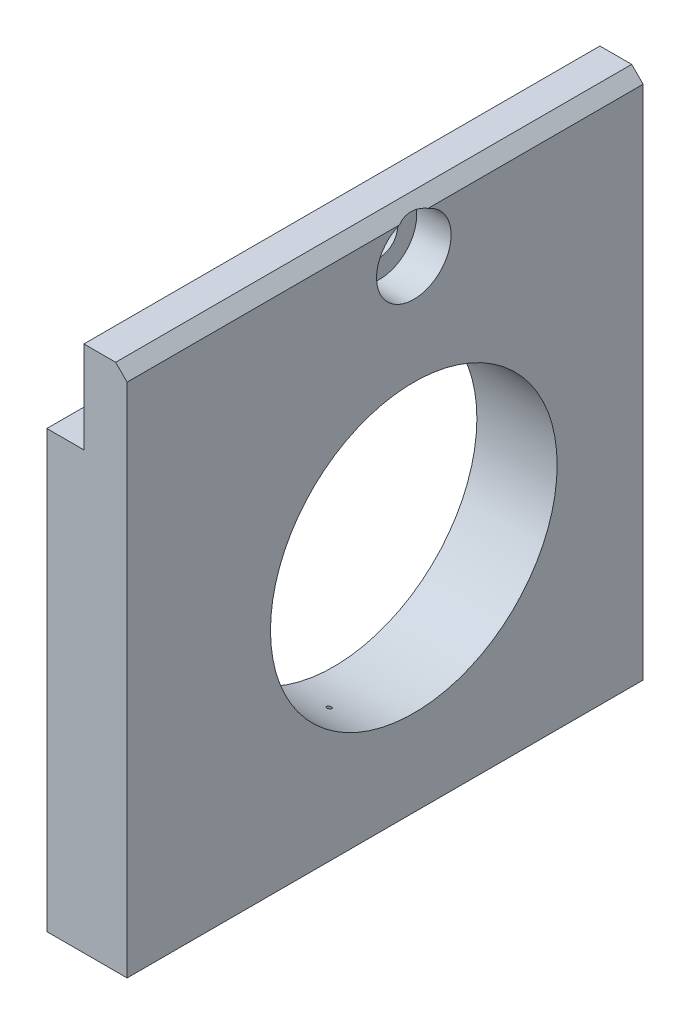
ISO-10303-21;
HEADER;
FILE_DESCRIPTION(('STEP AP214'),'2;1');
FILE_NAME('part.step','',(''),(''),'','','');
FILE_SCHEMA(('AUTOMOTIVE_DESIGN { 1 0 10303 214 1 1 1 1 }'));
ENDSEC;
DATA;
#1=APPLICATION_CONTEXT('core data for automotive mechanical design processes');
#2=APPLICATION_PROTOCOL_DEFINITION('international standard','automotive_design',2000,#1);
#3=PRODUCT_CONTEXT('',#1,'mechanical');
#4=PRODUCT('Part','Part','',(#3));
#5=PRODUCT_RELATED_PRODUCT_CATEGORY('part','',(#4));
#6=PRODUCT_DEFINITION_FORMATION('','',#4);
#7=PRODUCT_DEFINITION_CONTEXT('part definition',#1,'design');
#8=PRODUCT_DEFINITION('design','',#6,#7);
#9=PRODUCT_DEFINITION_SHAPE('','',#8);
#10=(LENGTH_UNIT() NAMED_UNIT(*) SI_UNIT(.MILLI.,.METRE.));
#11=(NAMED_UNIT(*) PLANE_ANGLE_UNIT() SI_UNIT($,.RADIAN.));
#12=(NAMED_UNIT(*) SI_UNIT($,.STERADIAN.) SOLID_ANGLE_UNIT());
#13=UNCERTAINTY_MEASURE_WITH_UNIT(LENGTH_MEASURE(1.E-05),#10,'distance_accuracy_value','');
#14=(GEOMETRIC_REPRESENTATION_CONTEXT(3) GLOBAL_UNCERTAINTY_ASSIGNED_CONTEXT((#13)) GLOBAL_UNIT_ASSIGNED_CONTEXT((#10,
#11,#12)) REPRESENTATION_CONTEXT('',''));
#15=CARTESIAN_POINT('',(0.,0.,0.));
#16=DIRECTION('',(0.,0.,1.));
#17=DIRECTION('',(1.,0.,0.));
#18=AXIS2_PLACEMENT_3D('',#15,#16,#17);
#19=CARTESIAN_POINT('',(0.,-15.6372549019608,45.));
#20=DIRECTION('',(0.,1.,0.));
#21=DIRECTION('',(0.,0.,1.));
#22=AXIS2_PLACEMENT_3D('',#19,#20,#21);
#23=PLANE('',#22);
#24=CARTESIAN_POINT('',(3.5,-15.6372549019608,38.));
#25=DIRECTION('',(0.,-1.,0.));
#26=DIRECTION('',(0.,0.,-1.));
#27=AXIS2_PLACEMENT_3D('',#24,#25,#26);
#28=CIRCLE('',#27,1.5);
#29=CARTESIAN_POINT('',(3.5,-15.6372549019608,36.5));
#30=VERTEX_POINT('',#29);
#31=EDGE_CURVE('E129',#30,#30,#28,.T.);
#32=ORIENTED_EDGE('',*,*,#31,.F.);
#33=EDGE_LOOP('',(#32));
#34=FACE_BOUND('',#33,.T.);
#35=CARTESIAN_POINT('',(3.5,-15.6372549019608,24.));
#36=DIRECTION('',(0.,-1.,0.));
#37=DIRECTION('',(0.,0.,-1.));
#38=AXIS2_PLACEMENT_3D('',#35,#36,#37);
#39=CIRCLE('',#38,1.24999999999999);
#40=CARTESIAN_POINT('',(3.5,-15.6372549019608,22.75));
#41=VERTEX_POINT('',#40);
#42=EDGE_CURVE('E139',#41,#41,#39,.T.);
#43=ORIENTED_EDGE('',*,*,#42,.F.);
#44=EDGE_LOOP('',(#43));
#45=FACE_BOUND('',#44,.T.);
#46=DIRECTION('',(1.,0.,0.));
#47=VECTOR('',#46,1.);
#48=CARTESIAN_POINT('',(0.,-15.6372549019608,0.));
#49=LINE('',#48,#47);
#50=CARTESIAN_POINT('',(0.,-15.6372549019608,0.));
#51=VERTEX_POINT('',#50);
#52=CARTESIAN_POINT('',(7.,-15.6372549019608,0.));
#53=VERTEX_POINT('',#52);
#54=EDGE_CURVE('E182',#51,#53,#49,.T.);
#55=ORIENTED_EDGE('',*,*,#54,.T.);
#56=DIRECTION('',(0.,0.,-1.));
#57=VECTOR('',#56,1.);
#58=CARTESIAN_POINT('',(7.,-15.6372549019608,45.));
#59=LINE('',#58,#57);
#60=CARTESIAN_POINT('',(7.,-15.6372549019608,45.));
#61=VERTEX_POINT('',#60);
#62=EDGE_CURVE('E173',#61,#53,#59,.T.);
#63=ORIENTED_EDGE('',*,*,#62,.F.);
#64=DIRECTION('',(1.,0.,0.));
#65=VECTOR('',#64,1.);
#66=CARTESIAN_POINT('',(0.,-15.6372549019608,45.));
#67=LINE('',#66,#65);
#68=CARTESIAN_POINT('',(0.,-15.6372549019608,45.));
#69=VERTEX_POINT('',#68);
#70=EDGE_CURVE('E169',#69,#61,#67,.T.);
#71=ORIENTED_EDGE('',*,*,#70,.F.);
#72=DIRECTION('',(0.,0.,-1.));
#73=VECTOR('',#72,1.);
#74=CARTESIAN_POINT('',(0.,-15.6372549019608,45.));
#75=LINE('',#74,#73);
#76=EDGE_CURVE('E188',#69,#51,#75,.T.);
#77=ORIENTED_EDGE('',*,*,#76,.T.);
#78=EDGE_LOOP('',(#55,#63,#71,#77));
#79=FACE_BOUND('',#78,.T.);
#80=CARTESIAN_POINT('',(3.5,-15.6372549019608,7.));
#81=DIRECTION('',(0.,-1.,0.));
#82=DIRECTION('',(0.,0.,-1.));
#83=AXIS2_PLACEMENT_3D('',#80,#81,#82);
#84=CIRCLE('',#83,1.5);
#85=CARTESIAN_POINT('',(3.5,-15.6372549019608,5.5));
#86=VERTEX_POINT('',#85);
#87=EDGE_CURVE('E128',#86,#86,#84,.T.);
#88=ORIENTED_EDGE('',*,*,#87,.F.);
#89=EDGE_LOOP('',(#88));
#90=FACE_BOUND('',#89,.T.);
#91=ADVANCED_FACE('F42',(#34,#45,#79,#90),#23,.F.);
#92=CARTESIAN_POINT('',(7.,-15.6372549019608,45.));
#93=DIRECTION('',(-1.,0.,0.));
#94=DIRECTION('',(0.,0.,1.));
#95=AXIS2_PLACEMENT_3D('',#92,#93,#94);
#96=PLANE('',#95);
#97=DIRECTION('',(0.,1.,0.));
#98=VECTOR('',#97,1.);
#99=CARTESIAN_POINT('',(7.,-15.6372549019608,0.));
#100=LINE('',#99,#98);
#101=CARTESIAN_POINT('',(7.,29.3627450980392,0.));
#102=VERTEX_POINT('',#101);
#103=EDGE_CURVE('E163',#53,#102,#100,.T.);
#104=ORIENTED_EDGE('',*,*,#103,.T.);
#105=DIRECTION('',(0.,0.,1.));
#106=VECTOR('',#105,1.);
#107=CARTESIAN_POINT('',(7.,29.3627450980392,45.));
#108=LINE('',#107,#106);
#109=CARTESIAN_POINT('',(7.,29.3627450980392,18.75));
#110=VERTEX_POINT('',#109);
#111=EDGE_CURVE('E208',#102,#110,#108,.T.);
#112=ORIENTED_EDGE('',*,*,#111,.T.);
#113=CARTESIAN_POINT('',(7.,26.3627450980392,20.));
#114=DIRECTION('',(1.,0.,0.));
#115=DIRECTION('',(0.,0.,-1.));
#116=AXIS2_PLACEMENT_3D('',#113,#114,#115);
#117=CIRCLE('',#116,3.25);
#118=CARTESIAN_POINT('',(7.,29.3627450980392,21.25));
#119=VERTEX_POINT('',#118);
#120=EDGE_CURVE('E151',#119,#110,#117,.T.);
#121=ORIENTED_EDGE('',*,*,#120,.F.);
#122=DIRECTION('',(0.,0.,1.));
#123=VECTOR('',#122,1.);
#124=CARTESIAN_POINT('',(7.,29.3627450980392,45.));
#125=LINE('',#124,#123);
#126=CARTESIAN_POINT('',(7.,29.3627450980392,45.));
#127=VERTEX_POINT('',#126);
#128=EDGE_CURVE('E64',#119,#127,#125,.T.);
#129=ORIENTED_EDGE('',*,*,#128,.T.);
#130=DIRECTION('',(0.,1.,0.));
#131=VECTOR('',#130,1.);
#132=CARTESIAN_POINT('',(7.,-15.6372549019608,45.));
#133=LINE('',#132,#131);
#134=EDGE_CURVE('E171',#61,#127,#133,.T.);
#135=ORIENTED_EDGE('',*,*,#134,.F.);
#136=ORIENTED_EDGE('',*,*,#62,.T.);
#137=EDGE_LOOP('',(#104,#112,#121,#129,#135,#136));
#138=FACE_BOUND('',#137,.T.);
#139=CARTESIAN_POINT('',(7.,4.36274509803914,20.));
#140=DIRECTION('',(1.,0.,0.));
#141=DIRECTION('',(0.,0.,-1.));
#142=AXIS2_PLACEMENT_3D('',#139,#140,#141);
#143=CIRCLE('',#142,12.5);
#144=CARTESIAN_POINT('',(7.,4.36274509803914,7.50000000000001));
#145=VERTEX_POINT('',#144);
#146=EDGE_CURVE('E145',#145,#145,#143,.T.);
#147=ORIENTED_EDGE('',*,*,#146,.F.);
#148=EDGE_LOOP('',(#147));
#149=FACE_BOUND('',#148,.T.);
#150=ADVANCED_FACE('F211',(#138,#149),#96,.F.);
#151=CARTESIAN_POINT('',(3.23,30.3627450980392,45.));
#152=DIRECTION('',(0.,-1.,0.));
#153=DIRECTION('',(0.,0.,-1.));
#154=AXIS2_PLACEMENT_3D('',#151,#152,#153);
#155=PLANE('',#154);
#156=DIRECTION('',(-1.,0.,0.));
#157=VECTOR('',#156,1.);
#158=CARTESIAN_POINT('',(3.23,30.3627450980392,45.));
#159=LINE('',#158,#157);
#160=CARTESIAN_POINT('',(6.,30.3627450980392,45.));
#161=VERTEX_POINT('',#160);
#162=CARTESIAN_POINT('',(3.23,30.3627450980392,45.));
#163=VERTEX_POINT('',#162);
#164=EDGE_CURVE('E160',#161,#163,#159,.T.);
#165=ORIENTED_EDGE('',*,*,#164,.F.);
#166=DIRECTION('',(0.,0.,-1.));
#167=VECTOR('',#166,1.);
#168=CARTESIAN_POINT('',(6.,30.3627450980392,45.));
#169=LINE('',#168,#167);
#170=CARTESIAN_POINT('',(6.,30.3627450980392,0.));
#171=VERTEX_POINT('',#170);
#172=EDGE_CURVE('E200',#161,#171,#169,.T.);
#173=ORIENTED_EDGE('',*,*,#172,.T.);
#174=DIRECTION('',(-1.,0.,0.));
#175=VECTOR('',#174,1.);
#176=CARTESIAN_POINT('',(3.23,30.3627450980392,0.));
#177=LINE('',#176,#175);
#178=CARTESIAN_POINT('',(3.23,30.3627450980392,0.));
#179=VERTEX_POINT('',#178);
#180=EDGE_CURVE('E174',#171,#179,#177,.T.);
#181=ORIENTED_EDGE('',*,*,#180,.T.);
#182=DIRECTION('',(0.,0.,-1.));
#183=VECTOR('',#182,1.);
#184=CARTESIAN_POINT('',(3.23,30.3627450980392,45.));
#185=LINE('',#184,#183);
#186=EDGE_CURVE('E197',#163,#179,#185,.T.);
#187=ORIENTED_EDGE('',*,*,#186,.F.);
#188=EDGE_LOOP('',(#165,#173,#181,#187));
#189=FACE_BOUND('',#188,.T.);
#190=ADVANCED_FACE('F224',(#189),#155,.F.);
#191=CARTESIAN_POINT('',(3.23,30.3627450980392,45.));
#192=DIRECTION('',(1.,0.,0.));
#193=DIRECTION('',(0.,1.,0.));
#194=AXIS2_PLACEMENT_3D('',#191,#192,#193);
#195=PLANE('',#194);
#196=CARTESIAN_POINT('',(3.23,26.3627450980392,20.));
#197=DIRECTION('',(1.,0.,0.));
#198=DIRECTION('',(0.,1.,0.));
#199=AXIS2_PLACEMENT_3D('',#196,#197,#198);
#200=CIRCLE('',#199,1.6);
#201=CARTESIAN_POINT('',(3.23,27.9627450980392,20.));
#202=VERTEX_POINT('',#201);
#203=EDGE_CURVE('E159',#202,#202,#200,.T.);
#204=ORIENTED_EDGE('',*,*,#203,.T.);
#205=EDGE_LOOP('',(#204));
#206=FACE_BOUND('',#205,.T.);
#207=DIRECTION('',(0.,-1.,0.));
#208=VECTOR('',#207,1.);
#209=CARTESIAN_POINT('',(3.23,30.3627450980392,0.));
#210=LINE('',#209,#208);
#211=CARTESIAN_POINT('',(3.23,22.3627450980392,0.));
#212=VERTEX_POINT('',#211);
#213=EDGE_CURVE('E176',#179,#212,#210,.T.);
#214=ORIENTED_EDGE('',*,*,#213,.T.);
#215=DIRECTION('',(0.,0.,-1.));
#216=VECTOR('',#215,1.);
#217=CARTESIAN_POINT('',(3.23,22.3627450980392,45.));
#218=LINE('',#217,#216);
#219=CARTESIAN_POINT('',(3.23,22.3627450980392,45.));
#220=VERTEX_POINT('',#219);
#221=EDGE_CURVE('E194',#220,#212,#218,.T.);
#222=ORIENTED_EDGE('',*,*,#221,.F.);
#223=DIRECTION('',(0.,-1.,0.));
#224=VECTOR('',#223,1.);
#225=CARTESIAN_POINT('',(3.23,30.3627450980392,45.));
#226=LINE('',#225,#224);
#227=EDGE_CURVE('E162',#163,#220,#226,.T.);
#228=ORIENTED_EDGE('',*,*,#227,.F.);
#229=ORIENTED_EDGE('',*,*,#186,.T.);
#230=EDGE_LOOP('',(#214,#222,#228,#229));
#231=FACE_BOUND('',#230,.T.);
#232=ADVANCED_FACE('F228',(#206,#231),#195,.F.);
#233=CARTESIAN_POINT('',(3.23,22.3627450980392,45.));
#234=DIRECTION('',(0.,-1.,0.));
#235=DIRECTION('',(0.,0.,-1.));
#236=AXIS2_PLACEMENT_3D('',#233,#234,#235);
#237=PLANE('',#236);
#238=DIRECTION('',(-1.,0.,0.));
#239=VECTOR('',#238,1.);
#240=CARTESIAN_POINT('',(3.23,22.3627450980392,0.));
#241=LINE('',#240,#239);
#242=CARTESIAN_POINT('',(0.,22.3627450980392,0.));
#243=VERTEX_POINT('',#242);
#244=EDGE_CURVE('E178',#212,#243,#241,.T.);
#245=ORIENTED_EDGE('',*,*,#244,.T.);
#246=DIRECTION('',(0.,0.,-1.));
#247=VECTOR('',#246,1.);
#248=CARTESIAN_POINT('',(0.,22.3627450980392,45.));
#249=LINE('',#248,#247);
#250=CARTESIAN_POINT('',(0.,22.3627450980392,45.));
#251=VERTEX_POINT('',#250);
#252=EDGE_CURVE('E191',#251,#243,#249,.T.);
#253=ORIENTED_EDGE('',*,*,#252,.F.);
#254=DIRECTION('',(-1.,0.,0.));
#255=VECTOR('',#254,1.);
#256=CARTESIAN_POINT('',(3.23,22.3627450980392,45.));
#257=LINE('',#256,#255);
#258=EDGE_CURVE('E165',#220,#251,#257,.T.);
#259=ORIENTED_EDGE('',*,*,#258,.F.);
#260=ORIENTED_EDGE('',*,*,#221,.T.);
#261=EDGE_LOOP('',(#245,#253,#259,#260));
#262=FACE_BOUND('',#261,.T.);
#263=ADVANCED_FACE('F235',(#262),#237,.F.);
#264=CARTESIAN_POINT('',(0.,22.3627450980392,45.));
#265=DIRECTION('',(1.,0.,0.));
#266=DIRECTION('',(0.,1.,0.));
#267=AXIS2_PLACEMENT_3D('',#264,#265,#266);
#268=PLANE('',#267);
#269=CARTESIAN_POINT('',(0.,4.36274509803914,20.));
#270=DIRECTION('',(1.,0.,0.));
#271=DIRECTION('',(0.,1.,0.));
#272=AXIS2_PLACEMENT_3D('',#269,#270,#271);
#273=CIRCLE('',#272,12.5);
#274=CARTESIAN_POINT('',(0.,16.8627450980391,20.));
#275=VERTEX_POINT('',#274);
#276=EDGE_CURVE('E148',#275,#275,#273,.T.);
#277=ORIENTED_EDGE('',*,*,#276,.T.);
#278=EDGE_LOOP('',(#277));
#279=FACE_BOUND('',#278,.T.);
#280=DIRECTION('',(0.,-1.,0.));
#281=VECTOR('',#280,1.);
#282=CARTESIAN_POINT('',(0.,22.3627450980392,0.));
#283=LINE('',#282,#281);
#284=EDGE_CURVE('E180',#243,#51,#283,.T.);
#285=ORIENTED_EDGE('',*,*,#284,.T.);
#286=ORIENTED_EDGE('',*,*,#76,.F.);
#287=DIRECTION('',(0.,-1.,0.));
#288=VECTOR('',#287,1.);
#289=CARTESIAN_POINT('',(0.,22.3627450980392,45.));
#290=LINE('',#289,#288);
#291=EDGE_CURVE('E167',#251,#69,#290,.T.);
#292=ORIENTED_EDGE('',*,*,#291,.F.);
#293=ORIENTED_EDGE('',*,*,#252,.T.);
#294=EDGE_LOOP('',(#285,#286,#292,#293));
#295=FACE_BOUND('',#294,.T.);
#296=ADVANCED_FACE('F239',(#279,#295),#268,.F.);
#297=CARTESIAN_POINT('',(0.,0.,45.));
#298=DIRECTION('',(0.,0.,1.));
#299=DIRECTION('',(1.,0.,0.));
#300=AXIS2_PLACEMENT_3D('',#297,#298,#299);
#301=PLANE('',#300);
#302=ORIENTED_EDGE('',*,*,#134,.T.);
#303=DIRECTION('',(0.707106781186542,-0.707106781186553,0.));
#304=VECTOR('',#303,1.);
#305=CARTESIAN_POINT('',(18.1813725490197,18.1813725490194,45.));
#306=LINE('',#305,#304);
#307=EDGE_CURVE('E11',#127,#161,#306,.F.);
#308=ORIENTED_EDGE('',*,*,#307,.T.);
#309=ORIENTED_EDGE('',*,*,#164,.T.);
#310=ORIENTED_EDGE('',*,*,#227,.T.);
#311=ORIENTED_EDGE('',*,*,#258,.T.);
#312=ORIENTED_EDGE('',*,*,#291,.T.);
#313=ORIENTED_EDGE('',*,*,#70,.T.);
#314=EDGE_LOOP('',(#302,#308,#309,#310,#311,#312,#313));
#315=FACE_BOUND('',#314,.T.);
#316=ADVANCED_FACE('F220',(#315),#301,.T.);
#317=CARTESIAN_POINT('',(0.,0.,0.));
#318=DIRECTION('',(0.,0.,1.));
#319=DIRECTION('',(1.,0.,0.));
#320=AXIS2_PLACEMENT_3D('',#317,#318,#319);
#321=PLANE('',#320);
#322=ORIENTED_EDGE('',*,*,#180,.F.);
#323=DIRECTION('',(-0.707106781186542,0.707106781186553,0.));
#324=VECTOR('',#323,1.);
#325=CARTESIAN_POINT('',(6.,30.3627450980392,0.));
#326=LINE('',#325,#324);
#327=EDGE_CURVE('E205',#171,#102,#326,.F.);
#328=ORIENTED_EDGE('',*,*,#327,.T.);
#329=ORIENTED_EDGE('',*,*,#103,.F.);
#330=ORIENTED_EDGE('',*,*,#54,.F.);
#331=ORIENTED_EDGE('',*,*,#284,.F.);
#332=ORIENTED_EDGE('',*,*,#244,.F.);
#333=ORIENTED_EDGE('',*,*,#213,.F.);
#334=EDGE_LOOP('',(#322,#328,#329,#330,#331,#332,#333));
#335=FACE_BOUND('',#334,.T.);
#336=ADVANCED_FACE('F246',(#335),#321,.F.);
#337=CARTESIAN_POINT('',(7.,26.3627450980392,20.));
#338=DIRECTION('',(1.,0.,0.));
#339=DIRECTION('',(0.,0.,-1.));
#340=AXIS2_PLACEMENT_3D('',#337,#338,#339);
#341=CYLINDRICAL_SURFACE('',#340,1.6);
#342=CARTESIAN_POINT('',(4.,26.3627450980392,20.));
#343=DIRECTION('',(1.,0.,0.));
#344=DIRECTION('',(0.,0.,-1.));
#345=AXIS2_PLACEMENT_3D('',#342,#343,#344);
#346=CIRCLE('',#345,1.6);
#347=CARTESIAN_POINT('',(4.,26.3627450980392,18.4));
#348=VERTEX_POINT('',#347);
#349=EDGE_CURVE('E156',#348,#348,#346,.T.);
#350=ORIENTED_EDGE('',*,*,#349,.T.);
#351=EDGE_LOOP('',(#350));
#352=FACE_BOUND('',#351,.T.);
#353=ORIENTED_EDGE('',*,*,#203,.F.);
#354=EDGE_LOOP('',(#353));
#355=FACE_BOUND('',#354,.T.);
#356=ADVANCED_FACE('F248',(#352,#355),#341,.F.);
#357=CARTESIAN_POINT('',(4.,27.9627450980392,20.));
#358=DIRECTION('',(-1.,0.,0.));
#359=DIRECTION('',(0.,0.,1.));
#360=AXIS2_PLACEMENT_3D('',#357,#358,#359);
#361=PLANE('',#360);
#362=ORIENTED_EDGE('',*,*,#349,.F.);
#363=EDGE_LOOP('',(#362));
#364=FACE_BOUND('',#363,.T.);
#365=CARTESIAN_POINT('',(4.,26.3627450980392,20.));
#366=DIRECTION('',(1.,0.,0.));
#367=DIRECTION('',(0.,0.,-1.));
#368=AXIS2_PLACEMENT_3D('',#365,#366,#367);
#369=CIRCLE('',#368,3.25);
#370=CARTESIAN_POINT('',(4.,26.3627450980392,16.75));
#371=VERTEX_POINT('',#370);
#372=EDGE_CURVE('E153',#371,#371,#369,.T.);
#373=ORIENTED_EDGE('',*,*,#372,.T.);
#374=EDGE_LOOP('',(#373));
#375=FACE_BOUND('',#374,.T.);
#376=ADVANCED_FACE('F254',(#364,#375),#361,.F.);
#377=CARTESIAN_POINT('',(7.,26.3627450980392,20.));
#378=DIRECTION('',(1.,0.,0.));
#379=DIRECTION('',(0.,0.,-1.));
#380=AXIS2_PLACEMENT_3D('',#377,#378,#379);
#381=CYLINDRICAL_SURFACE('',#380,3.25);
#382=ORIENTED_EDGE('',*,*,#372,.F.);
#383=EDGE_LOOP('',(#382));
#384=FACE_BOUND('',#383,.T.);
#385=ORIENTED_EDGE('',*,*,#120,.T.);
#386=CARTESIAN_POINT('',(9.99999999999994,26.3627450980392,20.));
#387=DIRECTION('',(-0.707106781186553,-0.707106781186542,0.));
#388=DIRECTION('',(0.707106781186542,-0.707106781186553,0.));
#389=AXIS2_PLACEMENT_3D('',#386,#387,#388);
#390=ELLIPSE('',#389,4.59619407771252,3.25);
#391=EDGE_CURVE('E57',#110,#119,#390,.F.);
#392=ORIENTED_EDGE('',*,*,#391,.T.);
#393=EDGE_LOOP('',(#385,#392));
#394=FACE_BOUND('',#393,.T.);
#395=ADVANCED_FACE('F215',(#384,#394),#381,.F.);
#396=CARTESIAN_POINT('',(7.,4.36274509803914,20.));
#397=DIRECTION('',(1.,0.,0.));
#398=DIRECTION('',(0.,0.,-1.));
#399=AXIS2_PLACEMENT_3D('',#396,#397,#398);
#400=CYLINDRICAL_SURFACE('',#399,12.5);
#401=CARTESIAN_POINT('',(3.51833158862185,-7.58802514290126,23.6645723690839));
#402=CARTESIAN_POINT('',(3.52777987175038,-7.58770091117651,23.66562979478));
#403=CARTESIAN_POINT('',(3.53714270538126,-7.58712562300601,23.6675056400141));
#404=CARTESIAN_POINT('',(3.55539609452204,-7.5855011410226,23.6727944739191));
#405=CARTESIAN_POINT('',(3.5642852526662,-7.58445062336478,23.6762117564886));
#406=CARTESIAN_POINT('',(3.58130012870609,-7.5819324055685,23.6843856242607));
#407=CARTESIAN_POINT('',(3.58942950657655,-7.58046685888149,23.6891352949638));
#408=CARTESIAN_POINT('',(3.60481314797535,-7.57717631334511,23.6997712893596));
#409=CARTESIAN_POINT('',(3.61206773707968,-7.57535144889536,23.7056571880402));
#410=CARTESIAN_POINT('',(3.62616167336648,-7.57124161772582,23.7188724918658));
#411=CARTESIAN_POINT('',(3.63291993987968,-7.56893137132576,23.7262801569721));
#412=CARTESIAN_POINT('',(3.6452545637446,-7.56403052128371,23.7419367608683));
#413=CARTESIAN_POINT('',(3.65083023794201,-7.56143975689152,23.7501861818669));
#414=CARTESIAN_POINT('',(3.66159489701522,-7.55559980985385,23.7687084559305));
#415=CARTESIAN_POINT('',(3.66657255693565,-7.55231215211173,23.7790919028507));
#416=CARTESIAN_POINT('',(3.67492104849221,-7.54552699138181,23.8004185812524));
#417=CARTESIAN_POINT('',(3.67829097711604,-7.54202937170358,23.8113621235102));
#418=CARTESIAN_POINT('',(3.6838804707304,-7.53430839322187,23.8354011972572));
#419=CARTESIAN_POINT('',(3.68581927802152,-7.53006035926984,23.8485543830764));
#420=CARTESIAN_POINT('',(3.68760930777372,-7.52147690369105,23.8749788247748));
#421=CARTESIAN_POINT('',(3.68745882266269,-7.51714141347634,23.8882501683708));
#422=CARTESIAN_POINT('',(3.68496635788966,-7.50798713283163,23.9161147489387));
#423=CARTESIAN_POINT('',(3.68237734697701,-7.50316939335438,23.9306868715527));
#424=CARTESIAN_POINT('',(3.67465478486403,-7.49368669425199,23.9591982224855));
#425=CARTESIAN_POINT('',(3.66952197077716,-7.48902169078601,23.9731376328676));
#426=CARTESIAN_POINT('',(3.65783583841741,-7.48081675973975,23.9975214610691));
#427=CARTESIAN_POINT('',(3.65169674357975,-7.47722416830208,24.0081468963185));
#428=CARTESIAN_POINT('',(3.6376775908046,-7.4703816483077,24.028302890449));
#429=CARTESIAN_POINT('',(3.62979999834812,-7.46713124401906,24.0378349710837));
#430=CARTESIAN_POINT('',(3.61403667920038,-7.46171134043809,24.0536756283167));
#431=CARTESIAN_POINT('',(3.60644942945427,-7.45945450241964,24.060250750403));
#432=CARTESIAN_POINT('',(3.59023549288567,-7.45536353544329,24.0721429073314));
#433=CARTESIAN_POINT('',(3.58160916282485,-7.45352926202692,24.0774603721344));
#434=CARTESIAN_POINT('',(3.56339450590617,-7.45038007538206,24.0865752532272));
#435=CARTESIAN_POINT('',(3.55379857149689,-7.4490697456228,24.0903592584954));
#436=CARTESIAN_POINT('',(3.53400242753935,-7.44709736268465,24.0960505893994));
#437=CARTESIAN_POINT('',(3.52380292162671,-7.44643456981241,24.0979600563671));
#438=CARTESIAN_POINT('',(3.50469776897272,-7.44586167117848,24.09961055199));
#439=CARTESIAN_POINT('',(3.49581775228868,-7.44585676904071,24.0996246821397));
#440=CARTESIAN_POINT('',(3.47819815761207,-7.44636462563542,24.0981615566495));
#441=CARTESIAN_POINT('',(3.46945855204349,-7.44687728142779,24.0966845975811));
#442=CARTESIAN_POINT('',(3.45281230501209,-7.44834602655181,24.0924480541438));
#443=CARTESIAN_POINT('',(3.44488587733885,-7.44927851523104,24.0897567194289));
#444=CARTESIAN_POINT('',(3.42956453752435,-7.45152575574529,24.0832604563798));
#445=CARTESIAN_POINT('',(3.42216974027769,-7.45284058990393,24.0794552882225));
#446=CARTESIAN_POINT('',(3.40735558727132,-7.4559329656849,24.0704880909078));
#447=CARTESIAN_POINT('',(3.40000045097536,-7.45774256948289,24.065231586917));
#448=CARTESIAN_POINT('',(3.38614834904365,-7.46167130432752,24.053789999813));
#449=CARTESIAN_POINT('',(3.37965185313597,-7.46379060347234,24.0476044123556));
#450=CARTESIAN_POINT('',(3.36645489693943,-7.46867760301705,24.0332993580296));
#451=CARTESIAN_POINT('',(3.35993194699571,-7.47149314443741,24.0250327348096));
#452=CARTESIAN_POINT('',(3.34815235259345,-7.47736651554209,24.0077226388628));
#453=CARTESIAN_POINT('',(3.34289654255459,-7.48042450312736,23.9986786595295));
#454=CARTESIAN_POINT('',(3.33269937774943,-7.48735049607033,23.9781119425875));
#455=CARTESIAN_POINT('',(3.328042334117,-7.49125622744582,23.9664606223171));
#456=CARTESIAN_POINT('',(3.32054478004542,-7.49920302775624,23.9426317165562));
#457=CARTESIAN_POINT('',(3.31770542583474,-7.50324418111658,23.9304538013462));
#458=CARTESIAN_POINT('',(3.31354614173276,-7.5120009494779,23.9039249233047));
#459=CARTESIAN_POINT('',(3.31252794443938,-7.516724495462,23.8895283885539));
#460=CARTESIAN_POINT('',(3.3129457791246,-7.52611242409307,23.8607378084664));
#461=CARTESIAN_POINT('',(3.31438389057061,-7.53077675323984,23.8463437755665));
#462=CARTESIAN_POINT('',(3.3198772840552,-7.54008452780698,23.8174448865779));
#463=CARTESIAN_POINT('',(3.32402633936839,-7.54472097352678,23.8029552227448));
#464=CARTESIAN_POINT('',(3.33510669139778,-7.55362470339109,23.7749629807828));
#465=CARTESIAN_POINT('',(3.34203296732659,-7.5578926369174,23.7614586730768));
#466=CARTESIAN_POINT('',(3.3563439354453,-7.56474747882035,23.7396541633915));
#467=CARTESIAN_POINT('',(3.36305850033925,-7.5674706722192,23.7309548710427));
#468=CARTESIAN_POINT('',(3.3778950087772,-7.57253731500832,23.7147147739862));
#469=CARTESIAN_POINT('',(3.38601622365007,-7.57488095980159,23.7071733732659));
#470=CARTESIAN_POINT('',(3.40361593687737,-7.57910639794792,23.6935395493336));
#471=CARTESIAN_POINT('',(3.41310438938202,-7.5809845023229,23.6874587107877));
#472=CARTESIAN_POINT('',(3.43315121464505,-7.58415070442055,23.6771877751677));
#473=CARTESIAN_POINT('',(3.44370874764076,-7.58543926090921,23.672996207965));
#474=CARTESIAN_POINT('',(3.4631802288821,-7.58713904896236,23.6674616941787));
#475=CARTESIAN_POINT('',(3.47196680009492,-7.58767851411856,23.6657027286408));
#476=CARTESIAN_POINT('',(3.48970997182463,-7.58831356875688,23.6636318161356));
#477=CARTESIAN_POINT('',(3.4986660400357,-7.58841037133671,23.6633159145163));
#478=CARTESIAN_POINT('',(3.51116846091965,-7.58823458400235,23.6638892619388));
#479=CARTESIAN_POINT('',(3.51475614311693,-7.58814783956975,23.6641722151193));
#480=CARTESIAN_POINT('',(3.51833158862185,-7.58802514290126,23.6645723690839));
#481=B_SPLINE_CURVE_WITH_KNOTS('',3,(#401,#402,#403,#404,#405,#406,#407,#408,#409,#410,#411,
#412,#413,#414,#415,#416,#417,#418,#419,#420,#421,#422,#423,#424,#425,#426,#427,#428,#429,#430,
#431,#432,#433,#434,#435,#436,#437,#438,#439,#440,#441,#442,#443,#444,#445,#446,#447,#448,#449,
#450,#451,#452,#453,#454,#455,#456,#457,#458,#459,#460,#461,#462,#463,#464,#465,#466,#467,#468,
#469,#470,#471,#472,#473,#474,#475,#476,#477,#478,#479,#480),.UNSPECIFIED.,.T.,.F.,(4,2,2,2,2,2,
2,2,2,2,2,2,2,2,2,2,2,2,2,2,2,2,2,2,2,2,2,2,2,2,2,2,2,2,2,2,2,2,2,4),(0.,0.0285272381698527,
0.0571344386326251,0.0855958428694442,0.114046621525377,0.144799205865089,0.175569507115688,
0.21135752384336,0.247165617982367,0.288869401290015,0.330607270973821,0.377086939422221,
0.423553147405285,0.461766327965,0.49992566015078,0.530676881060167,0.561417573667204,
0.592421593143404,0.623390154600257,0.649890800792897,0.676386177156223,0.70154889603175,
0.726717036762991,0.754272766013421,0.781843508059207,0.814424998816346,0.847027886446712,
0.88630078632233,0.925598642850951,0.970954985523698,1.01634974510657,1.06340434935963,
1.11037426693347,1.14420614327805,1.17802054620478,1.21209489675659,1.24614268652617,
1.27295651626242,1.29969681964321,1.31049217622751),.UNSPECIFIED.);
#482=CARTESIAN_POINT('',(3.51833158862185,-7.58802514290126,23.6645723690839));
#483=VERTEX_POINT('',#482);
#484=EDGE_CURVE('E47',#483,#483,#481,.T.);
#485=ORIENTED_EDGE('',*,*,#484,.T.);
#486=EDGE_LOOP('',(#485));
#487=FACE_BOUND('',#486,.T.);
#488=ORIENTED_EDGE('',*,*,#276,.F.);
#489=EDGE_LOOP('',(#488));
#490=FACE_BOUND('',#489,.T.);
#491=ORIENTED_EDGE('',*,*,#146,.T.);
#492=EDGE_LOOP('',(#491));
#493=FACE_BOUND('',#492,.T.);
#494=ADVANCED_FACE('F312',(#487,#490,#493),#400,.F.);
#495=CARTESIAN_POINT('',(6.,30.3627450980392,45.));
#496=DIRECTION('',(-0.707106781186553,-0.707106781186542,0.));
#497=DIRECTION('',(0.,0.,-1.));
#498=AXIS2_PLACEMENT_3D('',#495,#496,#497);
#499=PLANE('',#498);
#500=ORIENTED_EDGE('',*,*,#391,.F.);
#501=ORIENTED_EDGE('',*,*,#111,.F.);
#502=ORIENTED_EDGE('',*,*,#327,.F.);
#503=ORIENTED_EDGE('',*,*,#172,.F.);
#504=ORIENTED_EDGE('',*,*,#307,.F.);
#505=ORIENTED_EDGE('',*,*,#128,.F.);
#506=EDGE_LOOP('',(#500,#501,#502,#503,#504,#505));
#507=FACE_BOUND('',#506,.T.);
#508=ADVANCED_FACE('F45',(#507),#499,.F.);
#509=CARTESIAN_POINT('',(3.5,-8.13725490196079,24.));
#510=DIRECTION('',(0.,-1.,0.));
#511=DIRECTION('',(0.,0.,-1.));
#512=AXIS2_PLACEMENT_3D('',#509,#510,#511);
#513=CONICAL_SURFACE('',#512,1.24999999999999,1.02974425867664);
#514=CARTESIAN_POINT('',(3.5,-8.13725490196079,24.));
#515=DIRECTION('',(0.,-1.,0.));
#516=DIRECTION('',(0.,0.,-1.));
#517=AXIS2_PLACEMENT_3D('',#514,#515,#516);
#518=CIRCLE('',#517,1.24999999999999);
#519=CARTESIAN_POINT('',(3.5,-8.13725490196079,22.75));
#520=VERTEX_POINT('',#519);
#521=EDGE_CURVE('E142',#520,#520,#518,.T.);
#522=ORIENTED_EDGE('',*,*,#521,.T.);
#523=EDGE_LOOP('',(#522));
#524=FACE_BOUND('',#523,.T.);
#525=ORIENTED_EDGE('',*,*,#484,.F.);
#526=EDGE_LOOP('',(#525));
#527=FACE_BOUND('',#526,.T.);
#528=ADVANCED_FACE('F326',(#524,#527),#513,.F.);
#529=CARTESIAN_POINT('',(3.5,-15.6372549019608,24.));
#530=DIRECTION('',(0.,-1.,0.));
#531=DIRECTION('',(0.,0.,-1.));
#532=AXIS2_PLACEMENT_3D('',#529,#530,#531);
#533=CYLINDRICAL_SURFACE('',#532,1.24999999999999);
#534=ORIENTED_EDGE('',*,*,#521,.F.);
#535=EDGE_LOOP('',(#534));
#536=FACE_BOUND('',#535,.T.);
#537=ORIENTED_EDGE('',*,*,#42,.T.);
#538=EDGE_LOOP('',(#537));
#539=FACE_BOUND('',#538,.T.);
#540=ADVANCED_FACE('F342',(#536,#539),#533,.F.);
#541=CARTESIAN_POINT('',(3.5,-8.13725490196078,7.));
#542=DIRECTION('',(0.,-1.,0.));
#543=DIRECTION('',(0.,0.,-1.));
#544=AXIS2_PLACEMENT_3D('',#541,#542,#543);
#545=CONICAL_SURFACE('',#544,1.5,1.02974425867665);
#546=CARTESIAN_POINT('',(3.5,-7.23596397341944,7.));
#547=VERTEX_POINT('',#546);
#548=VERTEX_LOOP('',#547);
#549=FACE_BOUND('',#548,.T.);
#550=CARTESIAN_POINT('',(3.5,-8.13725490196078,7.));
#551=DIRECTION('',(0.,-1.,0.));
#552=DIRECTION('',(0.,0.,-1.));
#553=AXIS2_PLACEMENT_3D('',#550,#551,#552);
#554=CIRCLE('',#553,1.5);
#555=CARTESIAN_POINT('',(3.5,-8.13725490196078,5.5));
#556=VERTEX_POINT('',#555);
#557=EDGE_CURVE('E132',#556,#556,#554,.T.);
#558=ORIENTED_EDGE('',*,*,#557,.T.);
#559=EDGE_LOOP('',(#558));
#560=FACE_BOUND('',#559,.T.);
#561=ADVANCED_FACE('F352',(#549,#560),#545,.F.);
#562=CARTESIAN_POINT('',(3.5,-15.6372549019608,7.));
#563=DIRECTION('',(0.,-1.,0.));
#564=DIRECTION('',(0.,0.,-1.));
#565=AXIS2_PLACEMENT_3D('',#562,#563,#564);
#566=CYLINDRICAL_SURFACE('',#565,1.5);
#567=ORIENTED_EDGE('',*,*,#557,.F.);
#568=EDGE_LOOP('',(#567));
#569=FACE_BOUND('',#568,.T.);
#570=ORIENTED_EDGE('',*,*,#87,.T.);
#571=EDGE_LOOP('',(#570));
#572=FACE_BOUND('',#571,.T.);
#573=ADVANCED_FACE('F122',(#569,#572),#566,.F.);
#574=CARTESIAN_POINT('',(3.5,-8.13725490196078,38.));
#575=DIRECTION('',(0.,-1.,0.));
#576=DIRECTION('',(0.,0.,-1.));
#577=AXIS2_PLACEMENT_3D('',#574,#575,#576);
#578=CONICAL_SURFACE('',#577,1.5,1.02974425867665);
#579=CARTESIAN_POINT('',(3.5,-7.23596397341944,38.));
#580=VERTEX_POINT('',#579);
#581=VERTEX_LOOP('',#580);
#582=FACE_BOUND('',#581,.T.);
#583=CARTESIAN_POINT('',(3.5,-8.13725490196078,38.));
#584=DIRECTION('',(0.,-1.,0.));
#585=DIRECTION('',(0.,0.,-1.));
#586=AXIS2_PLACEMENT_3D('',#583,#584,#585);
#587=CIRCLE('',#586,1.5);
#588=CARTESIAN_POINT('',(3.5,-8.13725490196078,36.5));
#589=VERTEX_POINT('',#588);
#590=EDGE_CURVE('E126',#589,#589,#587,.T.);
#591=ORIENTED_EDGE('',*,*,#590,.T.);
#592=EDGE_LOOP('',(#591));
#593=FACE_BOUND('',#592,.T.);
#594=ADVANCED_FACE('F118',(#582,#593),#578,.F.);
#595=CARTESIAN_POINT('',(3.5,-15.6372549019608,38.));
#596=DIRECTION('',(0.,-1.,0.));
#597=DIRECTION('',(0.,0.,-1.));
#598=AXIS2_PLACEMENT_3D('',#595,#596,#597);
#599=CYLINDRICAL_SURFACE('',#598,1.5);
#600=ORIENTED_EDGE('',*,*,#590,.F.);
#601=EDGE_LOOP('',(#600));
#602=FACE_BOUND('',#601,.T.);
#603=ORIENTED_EDGE('',*,*,#31,.T.);
#604=EDGE_LOOP('',(#603));
#605=FACE_BOUND('',#604,.T.);
#606=ADVANCED_FACE('F121',(#602,#605),#599,.F.);
#607=CLOSED_SHELL('',(#91,#150,#190,#232,#263,#296,#316,#336,#356,#376,#395,#494,#508,#528,#540,
#561,#573,#594,#606));
#608=MANIFOLD_SOLID_BREP('B2',#607);
#609=ADVANCED_BREP_SHAPE_REPRESENTATION('',(#18,#608),#14);
#610=SHAPE_DEFINITION_REPRESENTATION(#9,#609);
ENDSEC;
END-ISO-10303-21;
